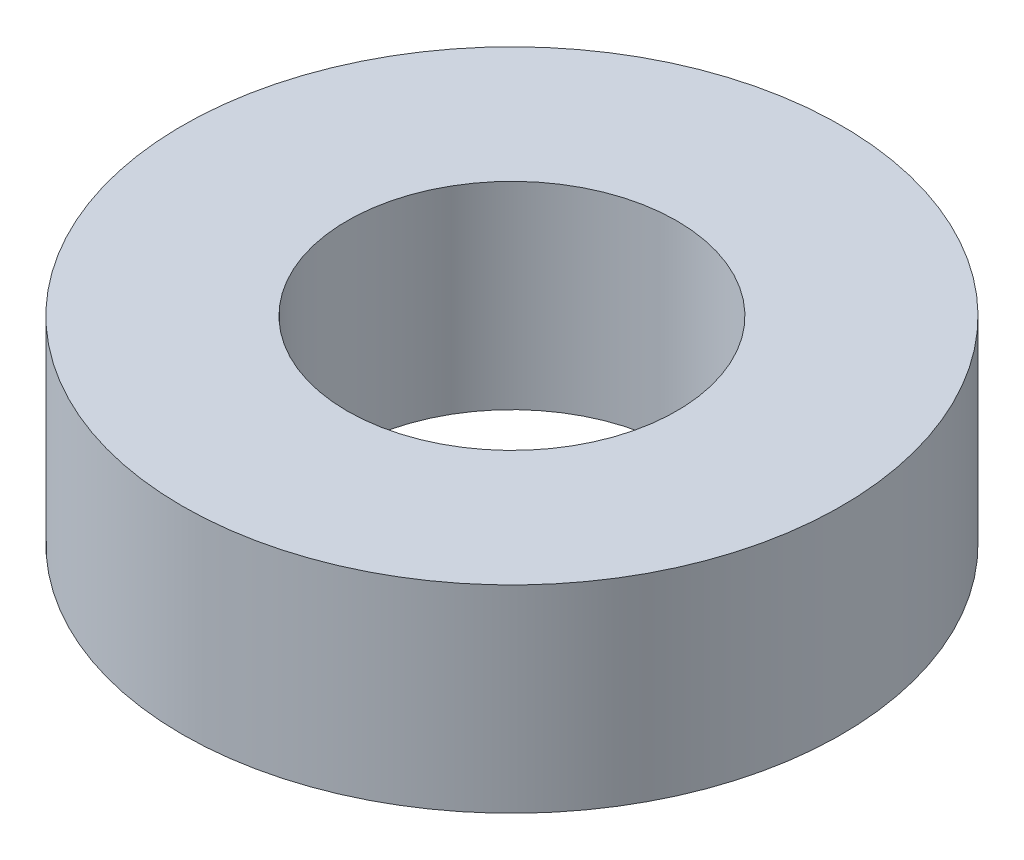
ISO-10303-21;
HEADER;
FILE_DESCRIPTION(('STEP AP214'),'2;1');
FILE_NAME('part.step','',(''),(''),'','','');
FILE_SCHEMA(('AUTOMOTIVE_DESIGN { 1 0 10303 214 1 1 1 1 }'));
ENDSEC;
DATA;
#1=APPLICATION_CONTEXT('core data for automotive mechanical design processes');
#2=APPLICATION_PROTOCOL_DEFINITION('international standard','automotive_design',2000,#1);
#3=PRODUCT_CONTEXT('',#1,'mechanical');
#4=PRODUCT('Part','Part','',(#3));
#5=PRODUCT_RELATED_PRODUCT_CATEGORY('part','',(#4));
#6=PRODUCT_DEFINITION_FORMATION('','',#4);
#7=PRODUCT_DEFINITION_CONTEXT('part definition',#1,'design');
#8=PRODUCT_DEFINITION('design','',#6,#7);
#9=PRODUCT_DEFINITION_SHAPE('','',#8);
#10=(LENGTH_UNIT() NAMED_UNIT(*) SI_UNIT(.MILLI.,.METRE.));
#11=(NAMED_UNIT(*) PLANE_ANGLE_UNIT() SI_UNIT($,.RADIAN.));
#12=(NAMED_UNIT(*) SI_UNIT($,.STERADIAN.) SOLID_ANGLE_UNIT());
#13=UNCERTAINTY_MEASURE_WITH_UNIT(LENGTH_MEASURE(1.E-05),#10,'distance_accuracy_value','');
#14=(GEOMETRIC_REPRESENTATION_CONTEXT(3) GLOBAL_UNCERTAINTY_ASSIGNED_CONTEXT((#13)) GLOBAL_UNIT_ASSIGNED_CONTEXT((#10,
#11,#12)) REPRESENTATION_CONTEXT('',''));
#15=CARTESIAN_POINT('',(0.,0.,0.));
#16=DIRECTION('',(0.,0.,1.));
#17=DIRECTION('',(1.,0.,0.));
#18=AXIS2_PLACEMENT_3D('',#15,#16,#17);
#19=CARTESIAN_POINT('',(0.,3.,0.));
#20=DIRECTION('',(0.,1.,0.));
#21=DIRECTION('',(0.,0.,1.));
#22=AXIS2_PLACEMENT_3D('',#19,#20,#21);
#23=PLANE('',#22);
#24=CARTESIAN_POINT('',(0.,3.,0.));
#25=DIRECTION('',(0.,1.,0.));
#26=DIRECTION('',(0.,0.,1.));
#27=AXIS2_PLACEMENT_3D('',#24,#25,#26);
#28=CIRCLE('',#27,5.);
#29=CARTESIAN_POINT('',(0.,3.,5.));
#30=VERTEX_POINT('',#29);
#31=EDGE_CURVE('E10',#30,#30,#28,.T.);
#32=ORIENTED_EDGE('',*,*,#31,.T.);
#33=EDGE_LOOP('',(#32));
#34=FACE_BOUND('',#33,.T.);
#35=CARTESIAN_POINT('',(0.,3.,0.));
#36=DIRECTION('',(0.,1.,0.));
#37=DIRECTION('',(0.,0.,1.));
#38=AXIS2_PLACEMENT_3D('',#35,#36,#37);
#39=CIRCLE('',#38,2.5);
#40=CARTESIAN_POINT('',(0.,3.,2.5));
#41=VERTEX_POINT('',#40);
#42=EDGE_CURVE('E52',#41,#41,#39,.T.);
#43=ORIENTED_EDGE('',*,*,#42,.F.);
#44=EDGE_LOOP('',(#43));
#45=FACE_BOUND('',#44,.T.);
#46=ADVANCED_FACE('F39',(#34,#45),#23,.T.);
#47=CARTESIAN_POINT('',(0.,0.,0.));
#48=DIRECTION('',(0.,1.,0.));
#49=DIRECTION('',(0.,0.,1.));
#50=AXIS2_PLACEMENT_3D('',#47,#48,#49);
#51=PLANE('',#50);
#52=CARTESIAN_POINT('',(0.,0.,0.));
#53=DIRECTION('',(0.,1.,0.));
#54=DIRECTION('',(0.,0.,1.));
#55=AXIS2_PLACEMENT_3D('',#52,#53,#54);
#56=CIRCLE('',#55,5.);
#57=CARTESIAN_POINT('',(0.,0.,5.));
#58=VERTEX_POINT('',#57);
#59=EDGE_CURVE('E43',#58,#58,#56,.T.);
#60=ORIENTED_EDGE('',*,*,#59,.F.);
#61=EDGE_LOOP('',(#60));
#62=FACE_BOUND('',#61,.T.);
#63=CARTESIAN_POINT('',(0.,0.,0.));
#64=DIRECTION('',(0.,1.,0.));
#65=DIRECTION('',(0.,0.,1.));
#66=AXIS2_PLACEMENT_3D('',#63,#64,#65);
#67=CIRCLE('',#66,2.5);
#68=CARTESIAN_POINT('',(0.,0.,2.5));
#69=VERTEX_POINT('',#68);
#70=EDGE_CURVE('E54',#69,#69,#67,.T.);
#71=ORIENTED_EDGE('',*,*,#70,.T.);
#72=EDGE_LOOP('',(#71));
#73=FACE_BOUND('',#72,.T.);
#74=ADVANCED_FACE('F66',(#62,#73),#51,.F.);
#75=CARTESIAN_POINT('',(0.,3.,0.));
#76=DIRECTION('',(0.,-1.,0.));
#77=DIRECTION('',(0.,0.,-1.));
#78=AXIS2_PLACEMENT_3D('',#75,#76,#77);
#79=CYLINDRICAL_SURFACE('',#78,5.);
#80=ORIENTED_EDGE('',*,*,#31,.F.);
#81=EDGE_LOOP('',(#80));
#82=FACE_BOUND('',#81,.T.);
#83=ORIENTED_EDGE('',*,*,#59,.T.);
#84=EDGE_LOOP('',(#83));
#85=FACE_BOUND('',#84,.T.);
#86=ADVANCED_FACE('F41',(#82,#85),#79,.T.);
#87=CARTESIAN_POINT('',(0.,3.,0.));
#88=DIRECTION('',(0.,-1.,0.));
#89=DIRECTION('',(0.,0.,-1.));
#90=AXIS2_PLACEMENT_3D('',#87,#88,#89);
#91=CYLINDRICAL_SURFACE('',#90,2.5);
#92=ORIENTED_EDGE('',*,*,#42,.T.);
#93=EDGE_LOOP('',(#92));
#94=FACE_BOUND('',#93,.T.);
#95=ORIENTED_EDGE('',*,*,#70,.F.);
#96=EDGE_LOOP('',(#95));
#97=FACE_BOUND('',#96,.T.);
#98=ADVANCED_FACE('F62',(#94,#97),#91,.F.);
#99=CLOSED_SHELL('',(#46,#74,#86,#98));
#100=MANIFOLD_SOLID_BREP('B2',#99);
#101=ADVANCED_BREP_SHAPE_REPRESENTATION('',(#18,#100),#14);
#102=SHAPE_DEFINITION_REPRESENTATION(#9,#101);
ENDSEC;
END-ISO-10303-21;
